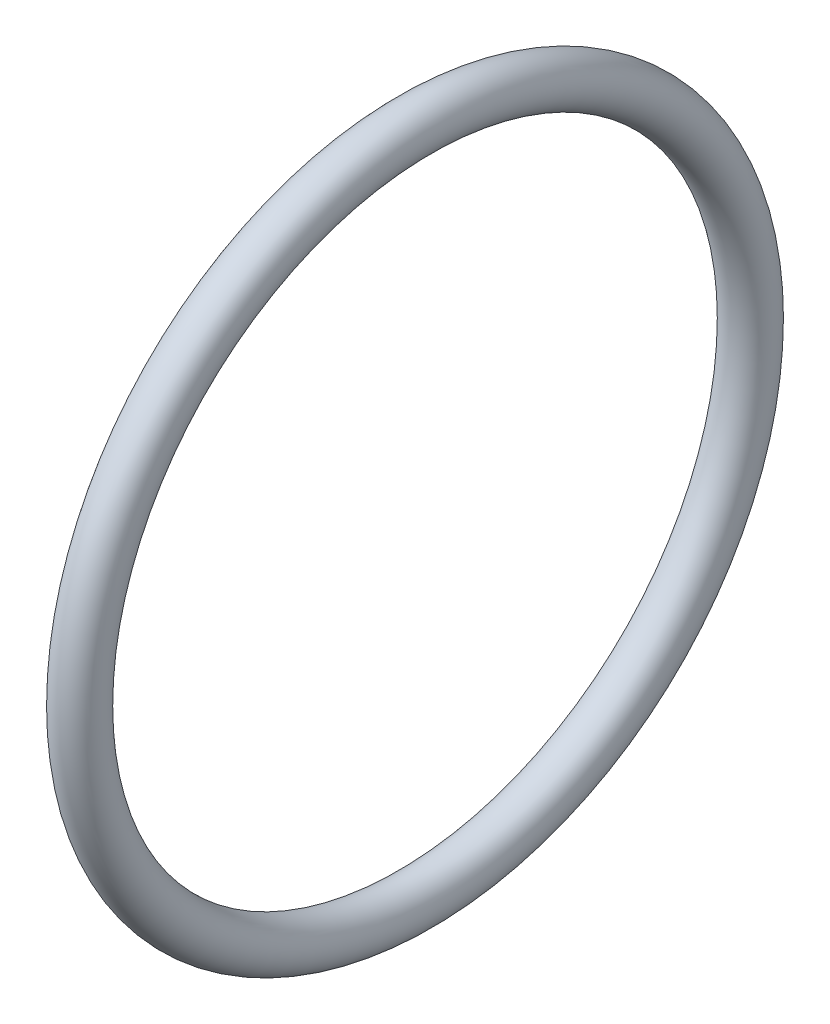
ISO-10303-21;
HEADER;
FILE_DESCRIPTION(('STEP AP214'),'2;1');
FILE_NAME('part.step','',(''),(''),'','','');
FILE_SCHEMA(('AUTOMOTIVE_DESIGN { 1 0 10303 214 1 1 1 1 }'));
ENDSEC;
DATA;
#1=APPLICATION_CONTEXT('core data for automotive mechanical design processes');
#2=APPLICATION_PROTOCOL_DEFINITION('international standard','automotive_design',2000,#1);
#3=PRODUCT_CONTEXT('',#1,'mechanical');
#4=PRODUCT('Part','Part','',(#3));
#5=PRODUCT_RELATED_PRODUCT_CATEGORY('part','',(#4));
#6=PRODUCT_DEFINITION_FORMATION('','',#4);
#7=PRODUCT_DEFINITION_CONTEXT('part definition',#1,'design');
#8=PRODUCT_DEFINITION('design','',#6,#7);
#9=PRODUCT_DEFINITION_SHAPE('','',#8);
#10=(LENGTH_UNIT() NAMED_UNIT(*) SI_UNIT(.MILLI.,.METRE.));
#11=(NAMED_UNIT(*) PLANE_ANGLE_UNIT() SI_UNIT($,.RADIAN.));
#12=(NAMED_UNIT(*) SI_UNIT($,.STERADIAN.) SOLID_ANGLE_UNIT());
#13=UNCERTAINTY_MEASURE_WITH_UNIT(LENGTH_MEASURE(1.E-05),#10,'distance_accuracy_value','');
#14=(GEOMETRIC_REPRESENTATION_CONTEXT(3) GLOBAL_UNCERTAINTY_ASSIGNED_CONTEXT((#13)) GLOBAL_UNIT_ASSIGNED_CONTEXT((#10,
#11,#12)) REPRESENTATION_CONTEXT('',''));
#15=CARTESIAN_POINT('',(0.,0.,0.));
#16=DIRECTION('',(0.,0.,1.));
#17=DIRECTION('',(1.,0.,0.));
#18=AXIS2_PLACEMENT_3D('',#15,#16,#17);
#19=CARTESIAN_POINT('',(10.429399639,0.,0.));
#20=DIRECTION('',(-1.,0.,0.));
#21=DIRECTION('',(0.,0.,1.));
#22=AXIS2_PLACEMENT_3D('',#19,#20,#21);
#23=TOROIDAL_SURFACE('',#22,6.449999927,0.449999989);
#24=CARTESIAN_POINT('',(10.429399639,0.,6.899999916));
#25=VERTEX_POINT('',#24);
#26=VERTEX_LOOP('',#25);
#27=FACE_BOUND('',#26,.T.);
#28=ADVANCED_FACE('F33',(#27),#23,.T.);
#29=CLOSED_SHELL('',(#28));
#30=MANIFOLD_SOLID_BREP('B2',#29);
#31=ADVANCED_BREP_SHAPE_REPRESENTATION('',(#18,#30),#14);
#32=SHAPE_DEFINITION_REPRESENTATION(#9,#31);
ENDSEC;
END-ISO-10303-21;
